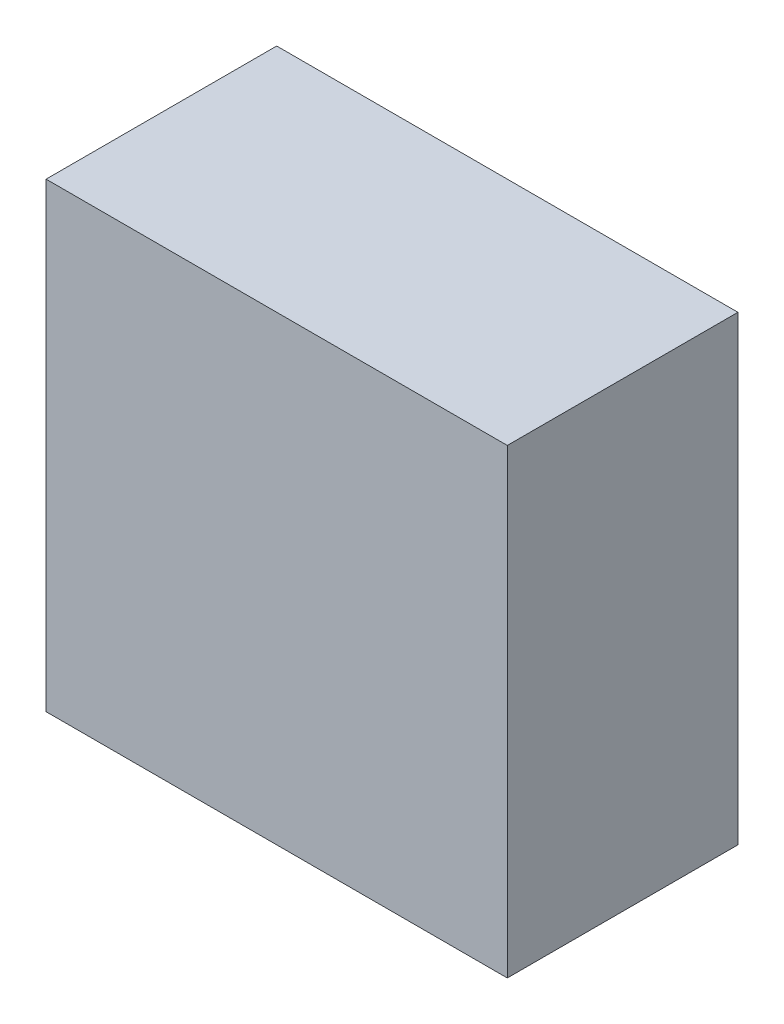
ISO-10303-21;
HEADER;
FILE_DESCRIPTION(('STEP AP214'),'2;1');
FILE_NAME('part.step','',(''),(''),'','','');
FILE_SCHEMA(('AUTOMOTIVE_DESIGN { 1 0 10303 214 1 1 1 1 }'));
ENDSEC;
DATA;
#1=APPLICATION_CONTEXT('core data for automotive mechanical design processes');
#2=APPLICATION_PROTOCOL_DEFINITION('international standard','automotive_design',2000,#1);
#3=PRODUCT_CONTEXT('',#1,'mechanical');
#4=PRODUCT('Part','Part','',(#3));
#5=PRODUCT_RELATED_PRODUCT_CATEGORY('part','',(#4));
#6=PRODUCT_DEFINITION_FORMATION('','',#4);
#7=PRODUCT_DEFINITION_CONTEXT('part definition',#1,'design');
#8=PRODUCT_DEFINITION('design','',#6,#7);
#9=PRODUCT_DEFINITION_SHAPE('','',#8);
#10=(LENGTH_UNIT() NAMED_UNIT(*) SI_UNIT(.MILLI.,.METRE.));
#11=(NAMED_UNIT(*) PLANE_ANGLE_UNIT() SI_UNIT($,.RADIAN.));
#12=(NAMED_UNIT(*) SI_UNIT($,.STERADIAN.) SOLID_ANGLE_UNIT());
#13=UNCERTAINTY_MEASURE_WITH_UNIT(LENGTH_MEASURE(1.E-05),#10,'distance_accuracy_value','');
#14=(GEOMETRIC_REPRESENTATION_CONTEXT(3) GLOBAL_UNCERTAINTY_ASSIGNED_CONTEXT((#13)) GLOBAL_UNIT_ASSIGNED_CONTEXT((#10,
#11,#12)) REPRESENTATION_CONTEXT('',''));
#15=CARTESIAN_POINT('',(0.,0.,0.));
#16=DIRECTION('',(0.,0.,1.));
#17=DIRECTION('',(1.,0.,0.));
#18=AXIS2_PLACEMENT_3D('',#15,#16,#17);
#19=CARTESIAN_POINT('',(0.,0.,0.));
#20=DIRECTION('',(0.,0.,1.));
#21=DIRECTION('',(1.,0.,0.));
#22=AXIS2_PLACEMENT_3D('',#19,#20,#21);
#23=PLANE('',#22);
#24=DIRECTION('',(0.,-1.,0.));
#25=VECTOR('',#24,1.);
#26=CARTESIAN_POINT('',(-50.3007518796993,48.7406015037594,0.));
#27=LINE('',#26,#25);
#28=CARTESIAN_POINT('',(-50.3007518796993,48.7406015037594,0.));
#29=VERTEX_POINT('',#28);
#30=CARTESIAN_POINT('',(-50.3007518796992,-71.2593984962406,0.));
#31=VERTEX_POINT('',#30);
#32=EDGE_CURVE('E89',#29,#31,#27,.T.);
#33=ORIENTED_EDGE('',*,*,#32,.F.);
#34=DIRECTION('',(-1.,0.,0.));
#35=VECTOR('',#34,1.);
#36=CARTESIAN_POINT('',(-50.3007518796993,48.7406015037594,0.));
#37=LINE('',#36,#35);
#38=CARTESIAN_POINT('',(69.6992481203008,48.7406015037594,0.));
#39=VERTEX_POINT('',#38);
#40=EDGE_CURVE('E141',#39,#29,#37,.T.);
#41=ORIENTED_EDGE('',*,*,#40,.F.);
#42=DIRECTION('',(0.,1.,0.));
#43=VECTOR('',#42,1.);
#44=CARTESIAN_POINT('',(69.6992481203008,48.7406015037594,0.));
#45=LINE('',#44,#43);
#46=CARTESIAN_POINT('',(69.6992481203008,-71.2593984962406,0.));
#47=VERTEX_POINT('',#46);
#48=EDGE_CURVE('E139',#47,#39,#45,.T.);
#49=ORIENTED_EDGE('',*,*,#48,.F.);
#50=DIRECTION('',(1.,0.,0.));
#51=VECTOR('',#50,1.);
#52=CARTESIAN_POINT('',(-50.3007518796992,-71.2593984962406,0.));
#53=LINE('',#52,#51);
#54=EDGE_CURVE('E137',#31,#47,#53,.T.);
#55=ORIENTED_EDGE('',*,*,#54,.F.);
#56=EDGE_LOOP('',(#33,#41,#49,#55));
#57=FACE_BOUND('',#56,.T.);
#58=DIRECTION('',(0.,-1.,0.));
#59=VECTOR('',#58,1.);
#60=CARTESIAN_POINT('',(-20.3007518796992,18.7406015037594,0.));
#61=LINE('',#60,#59);
#62=CARTESIAN_POINT('',(-20.3007518796992,18.7406015037594,0.));
#63=VERTEX_POINT('',#62);
#64=CARTESIAN_POINT('',(-20.3007518796992,-41.2593984962406,0.));
#65=VERTEX_POINT('',#64);
#66=EDGE_CURVE('E40',#63,#65,#61,.T.);
#67=ORIENTED_EDGE('',*,*,#66,.T.);
#68=DIRECTION('',(1.,0.,0.));
#69=VECTOR('',#68,1.);
#70=CARTESIAN_POINT('',(-20.3007518796992,-41.2593984962406,0.));
#71=LINE('',#70,#69);
#72=CARTESIAN_POINT('',(39.6992481203008,-41.2593984962406,0.));
#73=VERTEX_POINT('',#72);
#74=EDGE_CURVE('E121',#65,#73,#71,.T.);
#75=ORIENTED_EDGE('',*,*,#74,.T.);
#76=DIRECTION('',(0.,1.,0.));
#77=VECTOR('',#76,1.);
#78=CARTESIAN_POINT('',(39.6992481203008,18.7406015037594,0.));
#79=LINE('',#78,#77);
#80=CARTESIAN_POINT('',(39.6992481203008,18.7406015037594,0.));
#81=VERTEX_POINT('',#80);
#82=EDGE_CURVE('E124',#73,#81,#79,.T.);
#83=ORIENTED_EDGE('',*,*,#82,.T.);
#84=DIRECTION('',(-1.,0.,0.));
#85=VECTOR('',#84,1.);
#86=CARTESIAN_POINT('',(-20.3007518796992,18.7406015037594,0.));
#87=LINE('',#86,#85);
#88=EDGE_CURVE('E112',#81,#63,#87,.T.);
#89=ORIENTED_EDGE('',*,*,#88,.T.);
#90=EDGE_LOOP('',(#67,#75,#83,#89));
#91=FACE_BOUND('',#90,.T.);
#92=ADVANCED_FACE('F17',(#57,#91),#23,.F.);
#93=CARTESIAN_POINT('',(-50.3007518796993,48.7406015037594,50.));
#94=DIRECTION('',(1.,0.,0.));
#95=DIRECTION('',(0.,1.,0.));
#96=AXIS2_PLACEMENT_3D('',#93,#94,#95);
#97=PLANE('',#96);
#98=ORIENTED_EDGE('',*,*,#32,.T.);
#99=DIRECTION('',(0.,0.,-1.));
#100=VECTOR('',#99,1.);
#101=CARTESIAN_POINT('',(-50.3007518796992,-71.2593984962406,50.));
#102=LINE('',#101,#100);
#103=CARTESIAN_POINT('',(-50.3007518796993,-71.2593984962406,60.));
#104=VERTEX_POINT('',#103);
#105=EDGE_CURVE('E11',#104,#31,#102,.T.);
#106=ORIENTED_EDGE('',*,*,#105,.F.);
#107=DIRECTION('',(0.,-1.,0.));
#108=VECTOR('',#107,1.);
#109=CARTESIAN_POINT('',(-50.3007518796993,48.7406015037594,60.));
#110=LINE('',#109,#108);
#111=CARTESIAN_POINT('',(-50.3007518796993,48.7406015037594,60.));
#112=VERTEX_POINT('',#111);
#113=EDGE_CURVE('E87',#112,#104,#110,.T.);
#114=ORIENTED_EDGE('',*,*,#113,.F.);
#115=DIRECTION('',(0.,0.,-1.));
#116=VECTOR('',#115,1.);
#117=CARTESIAN_POINT('',(-50.3007518796993,48.7406015037594,50.));
#118=LINE('',#117,#116);
#119=EDGE_CURVE('E143',#112,#29,#118,.T.);
#120=ORIENTED_EDGE('',*,*,#119,.T.);
#121=EDGE_LOOP('',(#98,#106,#114,#120));
#122=FACE_BOUND('',#121,.T.);
#123=ADVANCED_FACE('F19',(#122),#97,.F.);
#124=CARTESIAN_POINT('',(-50.3007518796992,-71.2593984962406,50.));
#125=DIRECTION('',(0.,1.,0.));
#126=DIRECTION('',(0.,0.,1.));
#127=AXIS2_PLACEMENT_3D('',#124,#125,#126);
#128=PLANE('',#127);
#129=ORIENTED_EDGE('',*,*,#54,.T.);
#130=DIRECTION('',(0.,0.,-1.));
#131=VECTOR('',#130,1.);
#132=CARTESIAN_POINT('',(69.6992481203008,-71.2593984962406,50.));
#133=LINE('',#132,#131);
#134=CARTESIAN_POINT('',(69.6992481203008,-71.2593984962406,60.));
#135=VERTEX_POINT('',#134);
#136=EDGE_CURVE('E25',#135,#47,#133,.T.);
#137=ORIENTED_EDGE('',*,*,#136,.F.);
#138=DIRECTION('',(1.,0.,0.));
#139=VECTOR('',#138,1.);
#140=CARTESIAN_POINT('',(-50.3007518796993,-71.2593984962406,60.));
#141=LINE('',#140,#139);
#142=EDGE_CURVE('E92',#104,#135,#141,.T.);
#143=ORIENTED_EDGE('',*,*,#142,.F.);
#144=ORIENTED_EDGE('',*,*,#105,.T.);
#145=EDGE_LOOP('',(#129,#137,#143,#144));
#146=FACE_BOUND('',#145,.T.);
#147=ADVANCED_FACE('F93',(#146),#128,.F.);
#148=CARTESIAN_POINT('',(69.6992481203008,48.7406015037594,50.));
#149=DIRECTION('',(-1.,0.,0.));
#150=DIRECTION('',(0.,-1.,0.));
#151=AXIS2_PLACEMENT_3D('',#148,#149,#150);
#152=PLANE('',#151);
#153=ORIENTED_EDGE('',*,*,#48,.T.);
#154=DIRECTION('',(0.,0.,-1.));
#155=VECTOR('',#154,1.);
#156=CARTESIAN_POINT('',(69.6992481203008,48.7406015037594,50.));
#157=LINE('',#156,#155);
#158=CARTESIAN_POINT('',(69.6992481203008,48.7406015037594,60.));
#159=VERTEX_POINT('',#158);
#160=EDGE_CURVE('E145',#159,#39,#157,.T.);
#161=ORIENTED_EDGE('',*,*,#160,.F.);
#162=DIRECTION('',(0.,1.,0.));
#163=VECTOR('',#162,1.);
#164=CARTESIAN_POINT('',(69.6992481203008,48.7406015037594,60.));
#165=LINE('',#164,#163);
#166=EDGE_CURVE('E98',#135,#159,#165,.T.);
#167=ORIENTED_EDGE('',*,*,#166,.F.);
#168=ORIENTED_EDGE('',*,*,#136,.T.);
#169=EDGE_LOOP('',(#153,#161,#167,#168));
#170=FACE_BOUND('',#169,.T.);
#171=ADVANCED_FACE('F149',(#170),#152,.F.);
#172=CARTESIAN_POINT('',(-50.3007518796993,48.7406015037594,50.));
#173=DIRECTION('',(0.,-1.,0.));
#174=DIRECTION('',(0.,0.,-1.));
#175=AXIS2_PLACEMENT_3D('',#172,#173,#174);
#176=PLANE('',#175);
#177=ORIENTED_EDGE('',*,*,#40,.T.);
#178=ORIENTED_EDGE('',*,*,#119,.F.);
#179=DIRECTION('',(-1.,0.,0.));
#180=VECTOR('',#179,1.);
#181=CARTESIAN_POINT('',(-50.3007518796993,48.7406015037594,60.));
#182=LINE('',#181,#180);
#183=EDGE_CURVE('E103',#159,#112,#182,.T.);
#184=ORIENTED_EDGE('',*,*,#183,.F.);
#185=ORIENTED_EDGE('',*,*,#160,.T.);
#186=EDGE_LOOP('',(#177,#178,#184,#185));
#187=FACE_BOUND('',#186,.T.);
#188=ADVANCED_FACE('F154',(#187),#176,.F.);
#189=CARTESIAN_POINT('',(-20.3007518796992,18.7406015037594,50.));
#190=DIRECTION('',(1.,0.,0.));
#191=DIRECTION('',(0.,1.,0.));
#192=AXIS2_PLACEMENT_3D('',#189,#190,#191);
#193=PLANE('',#192);
#194=ORIENTED_EDGE('',*,*,#66,.F.);
#195=DIRECTION('',(0.,0.,-1.));
#196=VECTOR('',#195,1.);
#197=CARTESIAN_POINT('',(-20.3007518796992,18.7406015037594,50.));
#198=LINE('',#197,#196);
#199=CARTESIAN_POINT('',(-20.3007518796992,18.7406015037594,50.));
#200=VERTEX_POINT('',#199);
#201=EDGE_CURVE('E119',#200,#63,#198,.T.);
#202=ORIENTED_EDGE('',*,*,#201,.F.);
#203=DIRECTION('',(0.,-1.,0.));
#204=VECTOR('',#203,1.);
#205=CARTESIAN_POINT('',(-20.3007518796992,18.7406015037594,50.));
#206=LINE('',#205,#204);
#207=CARTESIAN_POINT('',(-20.3007518796992,-41.2593984962406,50.));
#208=VERTEX_POINT('',#207);
#209=EDGE_CURVE('E108',#200,#208,#206,.T.);
#210=ORIENTED_EDGE('',*,*,#209,.T.);
#211=DIRECTION('',(0.,0.,-1.));
#212=VECTOR('',#211,1.);
#213=CARTESIAN_POINT('',(-20.3007518796992,-41.2593984962406,50.));
#214=LINE('',#213,#212);
#215=EDGE_CURVE('E134',#208,#65,#214,.T.);
#216=ORIENTED_EDGE('',*,*,#215,.T.);
#217=EDGE_LOOP('',(#194,#202,#210,#216));
#218=FACE_BOUND('',#217,.T.);
#219=ADVANCED_FACE('F156',(#218),#193,.T.);
#220=CARTESIAN_POINT('',(-20.3007518796992,-41.2593984962406,50.));
#221=DIRECTION('',(0.,1.,0.));
#222=DIRECTION('',(0.,0.,1.));
#223=AXIS2_PLACEMENT_3D('',#220,#221,#222);
#224=PLANE('',#223);
#225=ORIENTED_EDGE('',*,*,#74,.F.);
#226=ORIENTED_EDGE('',*,*,#215,.F.);
#227=DIRECTION('',(1.,0.,0.));
#228=VECTOR('',#227,1.);
#229=CARTESIAN_POINT('',(-20.3007518796992,-41.2593984962406,50.));
#230=LINE('',#229,#228);
#231=CARTESIAN_POINT('',(39.6992481203008,-41.2593984962406,50.));
#232=VERTEX_POINT('',#231);
#233=EDGE_CURVE('E111',#208,#232,#230,.T.);
#234=ORIENTED_EDGE('',*,*,#233,.T.);
#235=DIRECTION('',(0.,0.,-1.));
#236=VECTOR('',#235,1.);
#237=CARTESIAN_POINT('',(39.6992481203008,-41.2593984962406,50.));
#238=LINE('',#237,#236);
#239=EDGE_CURVE('E132',#232,#73,#238,.T.);
#240=ORIENTED_EDGE('',*,*,#239,.T.);
#241=EDGE_LOOP('',(#225,#226,#234,#240));
#242=FACE_BOUND('',#241,.T.);
#243=ADVANCED_FACE('F164',(#242),#224,.T.);
#244=CARTESIAN_POINT('',(39.6992481203008,18.7406015037594,50.));
#245=DIRECTION('',(-1.,0.,0.));
#246=DIRECTION('',(0.,-1.,0.));
#247=AXIS2_PLACEMENT_3D('',#244,#245,#246);
#248=PLANE('',#247);
#249=ORIENTED_EDGE('',*,*,#82,.F.);
#250=ORIENTED_EDGE('',*,*,#239,.F.);
#251=DIRECTION('',(0.,1.,0.));
#252=VECTOR('',#251,1.);
#253=CARTESIAN_POINT('',(39.6992481203008,18.7406015037594,50.));
#254=LINE('',#253,#252);
#255=CARTESIAN_POINT('',(39.6992481203008,18.7406015037594,50.));
#256=VERTEX_POINT('',#255);
#257=EDGE_CURVE('E115',#232,#256,#254,.T.);
#258=ORIENTED_EDGE('',*,*,#257,.T.);
#259=DIRECTION('',(0.,0.,-1.));
#260=VECTOR('',#259,1.);
#261=CARTESIAN_POINT('',(39.6992481203008,18.7406015037594,50.));
#262=LINE('',#261,#260);
#263=EDGE_CURVE('E130',#256,#81,#262,.T.);
#264=ORIENTED_EDGE('',*,*,#263,.T.);
#265=EDGE_LOOP('',(#249,#250,#258,#264));
#266=FACE_BOUND('',#265,.T.);
#267=ADVANCED_FACE('F176',(#266),#248,.T.);
#268=CARTESIAN_POINT('',(-20.3007518796992,18.7406015037594,50.));
#269=DIRECTION('',(0.,-1.,0.));
#270=DIRECTION('',(0.,0.,-1.));
#271=AXIS2_PLACEMENT_3D('',#268,#269,#270);
#272=PLANE('',#271);
#273=ORIENTED_EDGE('',*,*,#88,.F.);
#274=ORIENTED_EDGE('',*,*,#263,.F.);
#275=DIRECTION('',(-1.,0.,0.));
#276=VECTOR('',#275,1.);
#277=CARTESIAN_POINT('',(-20.3007518796992,18.7406015037594,50.));
#278=LINE('',#277,#276);
#279=EDGE_CURVE('E32',#256,#200,#278,.T.);
#280=ORIENTED_EDGE('',*,*,#279,.T.);
#281=ORIENTED_EDGE('',*,*,#201,.T.);
#282=EDGE_LOOP('',(#273,#274,#280,#281));
#283=FACE_BOUND('',#282,.T.);
#284=ADVANCED_FACE('F180',(#283),#272,.T.);
#285=CARTESIAN_POINT('',(0.,0.,50.));
#286=DIRECTION('',(0.,0.,1.));
#287=DIRECTION('',(1.,0.,0.));
#288=AXIS2_PLACEMENT_3D('',#285,#286,#287);
#289=PLANE('',#288);
#290=ORIENTED_EDGE('',*,*,#233,.F.);
#291=ORIENTED_EDGE('',*,*,#209,.F.);
#292=ORIENTED_EDGE('',*,*,#279,.F.);
#293=ORIENTED_EDGE('',*,*,#257,.F.);
#294=EDGE_LOOP('',(#290,#291,#292,#293));
#295=FACE_BOUND('',#294,.T.);
#296=ADVANCED_FACE('F184',(#295),#289,.F.);
#297=CARTESIAN_POINT('',(0.,0.,60.));
#298=DIRECTION('',(0.,0.,1.));
#299=DIRECTION('',(1.,0.,0.));
#300=AXIS2_PLACEMENT_3D('',#297,#298,#299);
#301=PLANE('',#300);
#302=ORIENTED_EDGE('',*,*,#113,.T.);
#303=ORIENTED_EDGE('',*,*,#142,.T.);
#304=ORIENTED_EDGE('',*,*,#166,.T.);
#305=ORIENTED_EDGE('',*,*,#183,.T.);
#306=EDGE_LOOP('',(#302,#303,#304,#305));
#307=FACE_BOUND('',#306,.T.);
#308=ADVANCED_FACE('F101',(#307),#301,.T.);
#309=CLOSED_SHELL('',(#92,#123,#147,#171,#188,#219,#243,#267,#284,#296,#308));
#310=MANIFOLD_SOLID_BREP('B1',#309);
#311=ADVANCED_BREP_SHAPE_REPRESENTATION('',(#18,#310),#14);
#312=SHAPE_DEFINITION_REPRESENTATION(#9,#311);
ENDSEC;
END-ISO-10303-21;
